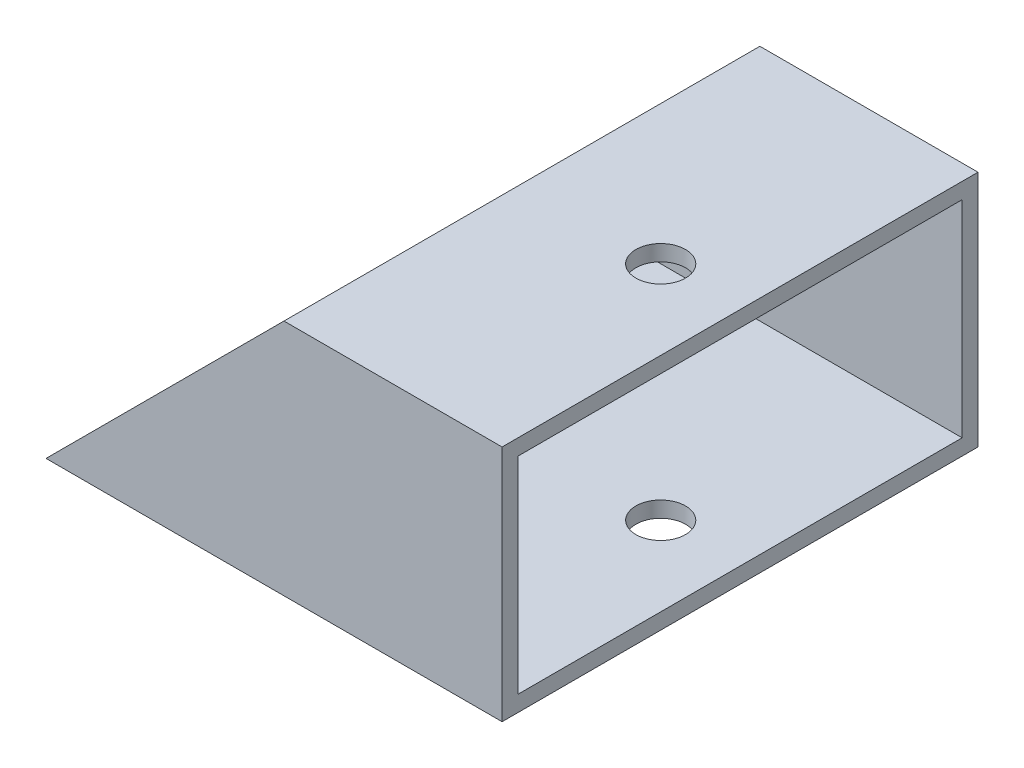
ISO-10303-21;
HEADER;
FILE_DESCRIPTION(('STEP AP214'),'2;1');
FILE_NAME('part.step','',(''),(''),'','','');
FILE_SCHEMA(('AUTOMOTIVE_DESIGN { 1 0 10303 214 1 1 1 1 }'));
ENDSEC;
DATA;
#1=APPLICATION_CONTEXT('core data for automotive mechanical design processes');
#2=APPLICATION_PROTOCOL_DEFINITION('international standard','automotive_design',2000,#1);
#3=PRODUCT_CONTEXT('',#1,'mechanical');
#4=PRODUCT('Part','Part','',(#3));
#5=PRODUCT_RELATED_PRODUCT_CATEGORY('part','',(#4));
#6=PRODUCT_DEFINITION_FORMATION('','',#4);
#7=PRODUCT_DEFINITION_CONTEXT('part definition',#1,'design');
#8=PRODUCT_DEFINITION('design','',#6,#7);
#9=PRODUCT_DEFINITION_SHAPE('','',#8);
#10=(LENGTH_UNIT() NAMED_UNIT(*) SI_UNIT(.MILLI.,.METRE.));
#11=(NAMED_UNIT(*) PLANE_ANGLE_UNIT() SI_UNIT($,.RADIAN.));
#12=(NAMED_UNIT(*) SI_UNIT($,.STERADIAN.) SOLID_ANGLE_UNIT());
#13=UNCERTAINTY_MEASURE_WITH_UNIT(LENGTH_MEASURE(1.E-05),#10,'distance_accuracy_value','');
#14=(GEOMETRIC_REPRESENTATION_CONTEXT(3) GLOBAL_UNCERTAINTY_ASSIGNED_CONTEXT((#13)) GLOBAL_UNIT_ASSIGNED_CONTEXT((#10,
#11,#12)) REPRESENTATION_CONTEXT('',''));
#15=CARTESIAN_POINT('',(0.,0.,0.));
#16=DIRECTION('',(0.,0.,1.));
#17=DIRECTION('',(1.,0.,0.));
#18=AXIS2_PLACEMENT_3D('',#15,#16,#17);
#19=CARTESIAN_POINT('',(101.6,19.05,-38.1));
#20=DIRECTION('',(0.,0.,1.));
#21=DIRECTION('',(1.,0.,0.));
#22=AXIS2_PLACEMENT_3D('',#19,#20,#21);
#23=PLANE('',#22);
#24=DIRECTION('',(-1.,0.,0.));
#25=VECTOR('',#24,1.);
#26=CARTESIAN_POINT('',(101.6,-19.05,-38.1));
#27=LINE('',#26,#25);
#28=CARTESIAN_POINT('',(101.6,-19.05,-38.1));
#29=VERTEX_POINT('',#28);
#30=CARTESIAN_POINT('',(28.575,-19.05,-38.1));
#31=VERTEX_POINT('',#30);
#32=EDGE_CURVE('E142',#29,#31,#27,.T.);
#33=ORIENTED_EDGE('',*,*,#32,.T.);
#34=DIRECTION('',(-0.707106781186544,-0.707106781186551,0.));
#35=VECTOR('',#34,1.);
#36=CARTESIAN_POINT('',(28.575,-19.05,-38.1));
#37=LINE('',#36,#35);
#38=CARTESIAN_POINT('',(66.6749999999996,19.05,-38.1));
#39=VERTEX_POINT('',#38);
#40=EDGE_CURVE('E81',#39,#31,#37,.T.);
#41=ORIENTED_EDGE('',*,*,#40,.F.);
#42=DIRECTION('',(-1.,0.,0.));
#43=VECTOR('',#42,1.);
#44=CARTESIAN_POINT('',(101.6,19.05,-38.1));
#45=LINE('',#44,#43);
#46=CARTESIAN_POINT('',(101.6,19.05,-38.1));
#47=VERTEX_POINT('',#46);
#48=EDGE_CURVE('E12',#47,#39,#45,.T.);
#49=ORIENTED_EDGE('',*,*,#48,.F.);
#50=DIRECTION('',(0.,1.,0.));
#51=VECTOR('',#50,1.);
#52=CARTESIAN_POINT('',(101.6,19.05,-38.1));
#53=LINE('',#52,#51);
#54=EDGE_CURVE('E152',#29,#47,#53,.T.);
#55=ORIENTED_EDGE('',*,*,#54,.F.);
#56=EDGE_LOOP('',(#33,#41,#49,#55));
#57=FACE_BOUND('',#56,.T.);
#58=ADVANCED_FACE('F58',(#57),#23,.F.);
#59=CARTESIAN_POINT('',(101.6,19.05,38.1));
#60=DIRECTION('',(0.,-1.,0.));
#61=DIRECTION('',(0.,0.,-1.));
#62=AXIS2_PLACEMENT_3D('',#59,#60,#61);
#63=PLANE('',#62);
#64=CARTESIAN_POINT('',(88.9,19.05,0.));
#65=DIRECTION('',(0.,1.,0.));
#66=DIRECTION('',(0.,0.,1.));
#67=AXIS2_PLACEMENT_3D('',#64,#65,#66);
#68=CIRCLE('',#67,3.97509999999999);
#69=CARTESIAN_POINT('',(88.9,19.05,3.97509999999999));
#70=VERTEX_POINT('',#69);
#71=EDGE_CURVE('E179',#70,#70,#68,.T.);
#72=ORIENTED_EDGE('',*,*,#71,.F.);
#73=EDGE_LOOP('',(#72));
#74=FACE_BOUND('',#73,.T.);
#75=ORIENTED_EDGE('',*,*,#48,.T.);
#76=DIRECTION('',(0.,0.,-1.));
#77=VECTOR('',#76,1.);
#78=CARTESIAN_POINT('',(66.6749999999996,19.05,38.1));
#79=LINE('',#78,#77);
#80=CARTESIAN_POINT('',(66.6749999999996,19.05,38.1));
#81=VERTEX_POINT('',#80);
#82=EDGE_CURVE('E124',#81,#39,#79,.T.);
#83=ORIENTED_EDGE('',*,*,#82,.F.);
#84=DIRECTION('',(-1.,0.,0.));
#85=VECTOR('',#84,1.);
#86=CARTESIAN_POINT('',(101.6,19.05,38.1));
#87=LINE('',#86,#85);
#88=CARTESIAN_POINT('',(101.6,19.05,38.1));
#89=VERTEX_POINT('',#88);
#90=EDGE_CURVE('E66',#89,#81,#87,.T.);
#91=ORIENTED_EDGE('',*,*,#90,.F.);
#92=DIRECTION('',(0.,0.,1.));
#93=VECTOR('',#92,1.);
#94=CARTESIAN_POINT('',(101.6,19.05,38.1));
#95=LINE('',#94,#93);
#96=EDGE_CURVE('E150',#47,#89,#95,.T.);
#97=ORIENTED_EDGE('',*,*,#96,.F.);
#98=EDGE_LOOP('',(#75,#83,#91,#97));
#99=FACE_BOUND('',#98,.T.);
#100=ADVANCED_FACE('F133',(#74,#99),#63,.F.);
#101=CARTESIAN_POINT('',(101.6,19.05,38.1));
#102=DIRECTION('',(0.,0.,-1.));
#103=DIRECTION('',(-1.,0.,0.));
#104=AXIS2_PLACEMENT_3D('',#101,#102,#103);
#105=PLANE('',#104);
#106=ORIENTED_EDGE('',*,*,#90,.T.);
#107=DIRECTION('',(-0.707106781186544,-0.707106781186551,0.));
#108=VECTOR('',#107,1.);
#109=CARTESIAN_POINT('',(28.575,-19.05,38.1));
#110=LINE('',#109,#108);
#111=CARTESIAN_POINT('',(28.575,-19.05,38.1));
#112=VERTEX_POINT('',#111);
#113=EDGE_CURVE('E121',#81,#112,#110,.T.);
#114=ORIENTED_EDGE('',*,*,#113,.T.);
#115=DIRECTION('',(-1.,0.,0.));
#116=VECTOR('',#115,1.);
#117=CARTESIAN_POINT('',(101.6,-19.05,38.1));
#118=LINE('',#117,#116);
#119=CARTESIAN_POINT('',(101.6,-19.05,38.1));
#120=VERTEX_POINT('',#119);
#121=EDGE_CURVE('E140',#120,#112,#118,.T.);
#122=ORIENTED_EDGE('',*,*,#121,.F.);
#123=DIRECTION('',(0.,-1.,0.));
#124=VECTOR('',#123,1.);
#125=CARTESIAN_POINT('',(101.6,19.05,38.1));
#126=LINE('',#125,#124);
#127=EDGE_CURVE('E139',#89,#120,#126,.T.);
#128=ORIENTED_EDGE('',*,*,#127,.F.);
#129=EDGE_LOOP('',(#106,#114,#122,#128));
#130=FACE_BOUND('',#129,.T.);
#131=ADVANCED_FACE('F138',(#130),#105,.F.);
#132=CARTESIAN_POINT('',(101.6,-19.05,38.1));
#133=DIRECTION('',(0.,1.,0.));
#134=DIRECTION('',(0.,0.,1.));
#135=AXIS2_PLACEMENT_3D('',#132,#133,#134);
#136=PLANE('',#135);
#137=CARTESIAN_POINT('',(41.275,-19.05,-25.4));
#138=DIRECTION('',(0.,1.,0.));
#139=DIRECTION('',(0.,0.,1.));
#140=AXIS2_PLACEMENT_3D('',#137,#138,#139);
#141=CIRCLE('',#140,1.5875);
#142=CARTESIAN_POINT('',(41.275,-19.05,-23.8125));
#143=VERTEX_POINT('',#142);
#144=EDGE_CURVE('E203',#143,#143,#141,.T.);
#145=ORIENTED_EDGE('',*,*,#144,.T.);
#146=EDGE_LOOP('',(#145));
#147=FACE_BOUND('',#146,.T.);
#148=CARTESIAN_POINT('',(41.275,-19.05,25.4));
#149=DIRECTION('',(0.,1.,0.));
#150=DIRECTION('',(0.,0.,1.));
#151=AXIS2_PLACEMENT_3D('',#148,#149,#150);
#152=CIRCLE('',#151,1.5875);
#153=CARTESIAN_POINT('',(41.275,-19.05,26.9875));
#154=VERTEX_POINT('',#153);
#155=EDGE_CURVE('E197',#154,#154,#152,.T.);
#156=ORIENTED_EDGE('',*,*,#155,.T.);
#157=EDGE_LOOP('',(#156));
#158=FACE_BOUND('',#157,.T.);
#159=CARTESIAN_POINT('',(41.275,-19.05,0.));
#160=DIRECTION('',(0.,1.,0.));
#161=DIRECTION('',(0.,0.,1.));
#162=AXIS2_PLACEMENT_3D('',#159,#160,#161);
#163=CIRCLE('',#162,1.5875);
#164=CARTESIAN_POINT('',(41.275,-19.05,1.58750000000001));
#165=VERTEX_POINT('',#164);
#166=EDGE_CURVE('E192',#165,#165,#163,.T.);
#167=ORIENTED_EDGE('',*,*,#166,.T.);
#168=EDGE_LOOP('',(#167));
#169=FACE_BOUND('',#168,.T.);
#170=CARTESIAN_POINT('',(88.9,-19.05,0.));
#171=DIRECTION('',(0.,1.,0.));
#172=DIRECTION('',(0.,0.,1.));
#173=AXIS2_PLACEMENT_3D('',#170,#171,#172);
#174=CIRCLE('',#173,3.97509999999999);
#175=CARTESIAN_POINT('',(88.9,-19.05,3.97509999999999));
#176=VERTEX_POINT('',#175);
#177=EDGE_CURVE('E182',#176,#176,#174,.T.);
#178=ORIENTED_EDGE('',*,*,#177,.T.);
#179=EDGE_LOOP('',(#178));
#180=FACE_BOUND('',#179,.T.);
#181=DIRECTION('',(0.,0.,1.));
#182=VECTOR('',#181,1.);
#183=CARTESIAN_POINT('',(28.575,-19.05,-38.1));
#184=LINE('',#183,#182);
#185=EDGE_CURVE('E125',#31,#112,#184,.T.);
#186=ORIENTED_EDGE('',*,*,#185,.F.);
#187=ORIENTED_EDGE('',*,*,#32,.F.);
#188=DIRECTION('',(0.,0.,-1.));
#189=VECTOR('',#188,1.);
#190=CARTESIAN_POINT('',(101.6,-19.05,38.1));
#191=LINE('',#190,#189);
#192=EDGE_CURVE('E147',#120,#29,#191,.T.);
#193=ORIENTED_EDGE('',*,*,#192,.F.);
#194=ORIENTED_EDGE('',*,*,#121,.T.);
#195=EDGE_LOOP('',(#186,#187,#193,#194));
#196=FACE_BOUND('',#195,.T.);
#197=ADVANCED_FACE('F212',(#147,#158,#169,#180,#196),#136,.F.);
#198=CARTESIAN_POINT('',(101.6,19.05,-35.56));
#199=DIRECTION('',(0.,0.,1.));
#200=DIRECTION('',(1.,0.,0.));
#201=AXIS2_PLACEMENT_3D('',#198,#199,#200);
#202=PLANE('',#201);
#203=DIRECTION('',(0.707106781186544,0.707106781186551,0.));
#204=VECTOR('',#203,1.);
#205=CARTESIAN_POINT('',(84.1374999999996,36.5125000000002,-35.56));
#206=LINE('',#205,#204);
#207=CARTESIAN_POINT('',(31.115,-16.51,-35.56));
#208=VERTEX_POINT('',#207);
#209=CARTESIAN_POINT('',(64.1349999999996,16.51,-35.56));
#210=VERTEX_POINT('',#209);
#211=EDGE_CURVE('E186',#208,#210,#206,.T.);
#212=ORIENTED_EDGE('',*,*,#211,.F.);
#213=DIRECTION('',(-1.,0.,0.));
#214=VECTOR('',#213,1.);
#215=CARTESIAN_POINT('',(101.6,-16.51,-35.56));
#216=LINE('',#215,#214);
#217=CARTESIAN_POINT('',(101.6,-16.51,-35.56));
#218=VERTEX_POINT('',#217);
#219=EDGE_CURVE('E164',#218,#208,#216,.T.);
#220=ORIENTED_EDGE('',*,*,#219,.F.);
#221=DIRECTION('',(0.,1.,0.));
#222=VECTOR('',#221,1.);
#223=CARTESIAN_POINT('',(101.6,19.05,-35.56));
#224=LINE('',#223,#222);
#225=CARTESIAN_POINT('',(101.6,16.51,-35.56));
#226=VERTEX_POINT('',#225);
#227=EDGE_CURVE('E174',#218,#226,#224,.T.);
#228=ORIENTED_EDGE('',*,*,#227,.T.);
#229=DIRECTION('',(-1.,0.,0.));
#230=VECTOR('',#229,1.);
#231=CARTESIAN_POINT('',(101.6,16.51,-35.56));
#232=LINE('',#231,#230);
#233=EDGE_CURVE('E155',#226,#210,#232,.T.);
#234=ORIENTED_EDGE('',*,*,#233,.T.);
#235=EDGE_LOOP('',(#212,#220,#228,#234));
#236=FACE_BOUND('',#235,.T.);
#237=ADVANCED_FACE('F245',(#236),#202,.T.);
#238=CARTESIAN_POINT('',(101.6,16.51,38.1));
#239=DIRECTION('',(0.,-1.,0.));
#240=DIRECTION('',(0.,0.,-1.));
#241=AXIS2_PLACEMENT_3D('',#238,#239,#240);
#242=PLANE('',#241);
#243=DIRECTION('',(0.,0.,1.));
#244=VECTOR('',#243,1.);
#245=CARTESIAN_POINT('',(64.1349999999996,16.51,38.1));
#246=LINE('',#245,#244);
#247=CARTESIAN_POINT('',(64.1349999999996,16.51,35.56));
#248=VERTEX_POINT('',#247);
#249=EDGE_CURVE('E188',#210,#248,#246,.T.);
#250=ORIENTED_EDGE('',*,*,#249,.F.);
#251=ORIENTED_EDGE('',*,*,#233,.F.);
#252=DIRECTION('',(0.,0.,1.));
#253=VECTOR('',#252,1.);
#254=CARTESIAN_POINT('',(101.6,16.51,38.1));
#255=LINE('',#254,#253);
#256=CARTESIAN_POINT('',(101.6,16.51,35.56));
#257=VERTEX_POINT('',#256);
#258=EDGE_CURVE('E172',#226,#257,#255,.T.);
#259=ORIENTED_EDGE('',*,*,#258,.T.);
#260=DIRECTION('',(-1.,0.,0.));
#261=VECTOR('',#260,1.);
#262=CARTESIAN_POINT('',(101.6,16.51,35.56));
#263=LINE('',#262,#261);
#264=EDGE_CURVE('E158',#257,#248,#263,.T.);
#265=ORIENTED_EDGE('',*,*,#264,.T.);
#266=EDGE_LOOP('',(#250,#251,#259,#265));
#267=FACE_BOUND('',#266,.T.);
#268=CARTESIAN_POINT('',(88.9,16.51,0.));
#269=DIRECTION('',(0.,-1.,0.));
#270=DIRECTION('',(0.,0.,-1.));
#271=AXIS2_PLACEMENT_3D('',#268,#269,#270);
#272=CIRCLE('',#271,3.97509999999999);
#273=CARTESIAN_POINT('',(88.9,16.51,-3.97509999999999));
#274=VERTEX_POINT('',#273);
#275=EDGE_CURVE('E176',#274,#274,#272,.T.);
#276=ORIENTED_EDGE('',*,*,#275,.F.);
#277=EDGE_LOOP('',(#276));
#278=FACE_BOUND('',#277,.T.);
#279=ADVANCED_FACE('F264',(#267,#278),#242,.T.);
#280=CARTESIAN_POINT('',(101.6,19.05,35.56));
#281=DIRECTION('',(0.,0.,-1.));
#282=DIRECTION('',(-1.,0.,0.));
#283=AXIS2_PLACEMENT_3D('',#280,#281,#282);
#284=PLANE('',#283);
#285=DIRECTION('',(-0.707106781186544,-0.707106781186551,0.));
#286=VECTOR('',#285,1.);
#287=CARTESIAN_POINT('',(84.1374999999996,36.5125000000002,35.56));
#288=LINE('',#287,#286);
#289=CARTESIAN_POINT('',(31.115,-16.51,35.56));
#290=VERTEX_POINT('',#289);
#291=EDGE_CURVE('E73',#248,#290,#288,.T.);
#292=ORIENTED_EDGE('',*,*,#291,.F.);
#293=ORIENTED_EDGE('',*,*,#264,.F.);
#294=DIRECTION('',(0.,-1.,0.));
#295=VECTOR('',#294,1.);
#296=CARTESIAN_POINT('',(101.6,19.05,35.56));
#297=LINE('',#296,#295);
#298=CARTESIAN_POINT('',(101.6,-16.51,35.56));
#299=VERTEX_POINT('',#298);
#300=EDGE_CURVE('E169',#257,#299,#297,.T.);
#301=ORIENTED_EDGE('',*,*,#300,.T.);
#302=DIRECTION('',(-1.,0.,0.));
#303=VECTOR('',#302,1.);
#304=CARTESIAN_POINT('',(101.6,-16.51,35.56));
#305=LINE('',#304,#303);
#306=EDGE_CURVE('E161',#299,#290,#305,.T.);
#307=ORIENTED_EDGE('',*,*,#306,.T.);
#308=EDGE_LOOP('',(#292,#293,#301,#307));
#309=FACE_BOUND('',#308,.T.);
#310=ADVANCED_FACE('F227',(#309),#284,.T.);
#311=CARTESIAN_POINT('',(101.6,-16.51,38.1));
#312=DIRECTION('',(0.,1.,0.));
#313=DIRECTION('',(0.,0.,1.));
#314=AXIS2_PLACEMENT_3D('',#311,#312,#313);
#315=PLANE('',#314);
#316=CARTESIAN_POINT('',(41.275,-16.51,-25.4));
#317=DIRECTION('',(0.,1.,0.));
#318=DIRECTION('',(0.,0.,1.));
#319=AXIS2_PLACEMENT_3D('',#316,#317,#318);
#320=CIRCLE('',#319,1.5875);
#321=CARTESIAN_POINT('',(41.275,-16.51,-23.8125));
#322=VERTEX_POINT('',#321);
#323=EDGE_CURVE('E200',#322,#322,#320,.T.);
#324=ORIENTED_EDGE('',*,*,#323,.F.);
#325=EDGE_LOOP('',(#324));
#326=FACE_BOUND('',#325,.T.);
#327=CARTESIAN_POINT('',(41.275,-16.51,25.4));
#328=DIRECTION('',(0.,1.,0.));
#329=DIRECTION('',(0.,0.,1.));
#330=AXIS2_PLACEMENT_3D('',#327,#328,#329);
#331=CIRCLE('',#330,1.5875);
#332=CARTESIAN_POINT('',(41.275,-16.51,26.9875));
#333=VERTEX_POINT('',#332);
#334=EDGE_CURVE('E206',#333,#333,#331,.T.);
#335=ORIENTED_EDGE('',*,*,#334,.F.);
#336=EDGE_LOOP('',(#335));
#337=FACE_BOUND('',#336,.T.);
#338=CARTESIAN_POINT('',(41.275,-16.51,0.));
#339=DIRECTION('',(0.,1.,0.));
#340=DIRECTION('',(0.,0.,1.));
#341=AXIS2_PLACEMENT_3D('',#338,#339,#340);
#342=CIRCLE('',#341,1.5875);
#343=CARTESIAN_POINT('',(41.275,-16.51,1.58750000000001));
#344=VERTEX_POINT('',#343);
#345=EDGE_CURVE('E194',#344,#344,#342,.T.);
#346=ORIENTED_EDGE('',*,*,#345,.F.);
#347=EDGE_LOOP('',(#346));
#348=FACE_BOUND('',#347,.T.);
#349=DIRECTION('',(0.,0.,-1.));
#350=VECTOR('',#349,1.);
#351=CARTESIAN_POINT('',(31.115,-16.51,38.1));
#352=LINE('',#351,#350);
#353=EDGE_CURVE('E136',#290,#208,#352,.T.);
#354=ORIENTED_EDGE('',*,*,#353,.F.);
#355=ORIENTED_EDGE('',*,*,#306,.F.);
#356=DIRECTION('',(0.,0.,-1.));
#357=VECTOR('',#356,1.);
#358=CARTESIAN_POINT('',(101.6,-16.51,38.1));
#359=LINE('',#358,#357);
#360=EDGE_CURVE('E167',#299,#218,#359,.T.);
#361=ORIENTED_EDGE('',*,*,#360,.T.);
#362=ORIENTED_EDGE('',*,*,#219,.T.);
#363=EDGE_LOOP('',(#354,#355,#361,#362));
#364=FACE_BOUND('',#363,.T.);
#365=CARTESIAN_POINT('',(88.9,-16.51,0.));
#366=DIRECTION('',(0.,1.,0.));
#367=DIRECTION('',(0.,0.,1.));
#368=AXIS2_PLACEMENT_3D('',#365,#366,#367);
#369=CIRCLE('',#368,3.97509999999999);
#370=CARTESIAN_POINT('',(88.9,-16.51,3.97509999999999));
#371=VERTEX_POINT('',#370);
#372=EDGE_CURVE('E61',#371,#371,#369,.T.);
#373=ORIENTED_EDGE('',*,*,#372,.F.);
#374=EDGE_LOOP('',(#373));
#375=FACE_BOUND('',#374,.T.);
#376=ADVANCED_FACE('F223',(#326,#337,#348,#364,#375),#315,.T.);
#377=CARTESIAN_POINT('',(101.6,0.,0.));
#378=DIRECTION('',(1.,0.,0.));
#379=DIRECTION('',(0.,0.,-1.));
#380=AXIS2_PLACEMENT_3D('',#377,#378,#379);
#381=PLANE('',#380);
#382=ORIENTED_EDGE('',*,*,#54,.T.);
#383=ORIENTED_EDGE('',*,*,#96,.T.);
#384=ORIENTED_EDGE('',*,*,#127,.T.);
#385=ORIENTED_EDGE('',*,*,#192,.T.);
#386=EDGE_LOOP('',(#382,#383,#384,#385));
#387=FACE_BOUND('',#386,.T.);
#388=ORIENTED_EDGE('',*,*,#258,.F.);
#389=ORIENTED_EDGE('',*,*,#227,.F.);
#390=ORIENTED_EDGE('',*,*,#360,.F.);
#391=ORIENTED_EDGE('',*,*,#300,.F.);
#392=EDGE_LOOP('',(#388,#389,#390,#391));
#393=FACE_BOUND('',#392,.T.);
#394=ADVANCED_FACE('F226',(#387,#393),#381,.T.);
#395=CARTESIAN_POINT('',(88.9,-19.05,0.));
#396=DIRECTION('',(0.,1.,0.));
#397=DIRECTION('',(0.,0.,1.));
#398=AXIS2_PLACEMENT_3D('',#395,#396,#397);
#399=CYLINDRICAL_SURFACE('',#398,3.97509999999999);
#400=ORIENTED_EDGE('',*,*,#372,.T.);
#401=EDGE_LOOP('',(#400));
#402=FACE_BOUND('',#401,.T.);
#403=ORIENTED_EDGE('',*,*,#177,.F.);
#404=EDGE_LOOP('',(#403));
#405=FACE_BOUND('',#404,.T.);
#406=ADVANCED_FACE('F236',(#402,#405),#399,.F.);
#407=ORIENTED_EDGE('',*,*,#275,.T.);
#408=EDGE_LOOP('',(#407));
#409=FACE_BOUND('',#408,.T.);
#410=ORIENTED_EDGE('',*,*,#71,.T.);
#411=EDGE_LOOP('',(#410));
#412=FACE_BOUND('',#411,.T.);
#413=ADVANCED_FACE('F239',(#409,#412),#399,.F.);
#414=CARTESIAN_POINT('',(28.575,-19.05,38.1));
#415=DIRECTION('',(0.707106781186551,-0.707106781186544,0.));
#416=DIRECTION('',(0.707106781186544,0.707106781186551,0.));
#417=AXIS2_PLACEMENT_3D('',#414,#415,#416);
#418=PLANE('',#417);
#419=ORIENTED_EDGE('',*,*,#211,.T.);
#420=ORIENTED_EDGE('',*,*,#249,.T.);
#421=ORIENTED_EDGE('',*,*,#291,.T.);
#422=ORIENTED_EDGE('',*,*,#353,.T.);
#423=EDGE_LOOP('',(#419,#420,#421,#422));
#424=FACE_BOUND('',#423,.T.);
#425=ORIENTED_EDGE('',*,*,#40,.T.);
#426=ORIENTED_EDGE('',*,*,#185,.T.);
#427=ORIENTED_EDGE('',*,*,#113,.F.);
#428=ORIENTED_EDGE('',*,*,#82,.T.);
#429=EDGE_LOOP('',(#425,#426,#427,#428));
#430=FACE_BOUND('',#429,.T.);
#431=ADVANCED_FACE('F123',(#424,#430),#418,.F.);
#432=CARTESIAN_POINT('',(41.275,-19.05,0.));
#433=DIRECTION('',(0.,1.,0.));
#434=DIRECTION('',(0.,0.,1.));
#435=AXIS2_PLACEMENT_3D('',#432,#433,#434);
#436=CYLINDRICAL_SURFACE('',#435,1.5875);
#437=ORIENTED_EDGE('',*,*,#166,.F.);
#438=EDGE_LOOP('',(#437));
#439=FACE_BOUND('',#438,.T.);
#440=ORIENTED_EDGE('',*,*,#345,.T.);
#441=EDGE_LOOP('',(#440));
#442=FACE_BOUND('',#441,.T.);
#443=ADVANCED_FACE('F219',(#439,#442),#436,.F.);
#444=CARTESIAN_POINT('',(41.275,-19.05,25.4));
#445=DIRECTION('',(0.,1.,0.));
#446=DIRECTION('',(0.,0.,1.));
#447=AXIS2_PLACEMENT_3D('',#444,#445,#446);
#448=CYLINDRICAL_SURFACE('',#447,1.5875);
#449=ORIENTED_EDGE('',*,*,#155,.F.);
#450=EDGE_LOOP('',(#449));
#451=FACE_BOUND('',#450,.T.);
#452=ORIENTED_EDGE('',*,*,#334,.T.);
#453=EDGE_LOOP('',(#452));
#454=FACE_BOUND('',#453,.T.);
#455=ADVANCED_FACE('F215',(#451,#454),#448,.F.);
#456=CARTESIAN_POINT('',(41.275,-19.05,-25.4));
#457=DIRECTION('',(0.,1.,0.));
#458=DIRECTION('',(0.,0.,1.));
#459=AXIS2_PLACEMENT_3D('',#456,#457,#458);
#460=CYLINDRICAL_SURFACE('',#459,1.5875);
#461=ORIENTED_EDGE('',*,*,#144,.F.);
#462=EDGE_LOOP('',(#461));
#463=FACE_BOUND('',#462,.T.);
#464=ORIENTED_EDGE('',*,*,#323,.T.);
#465=EDGE_LOOP('',(#464));
#466=FACE_BOUND('',#465,.T.);
#467=ADVANCED_FACE('F218',(#463,#466),#460,.F.);
#468=CLOSED_SHELL('',(#58,#100,#131,#197,#237,#279,#310,#376,#394,#406,#413,#431,#443,#455,#467));
#469=MANIFOLD_SOLID_BREP('B2',#468);
#470=ADVANCED_BREP_SHAPE_REPRESENTATION('',(#18,#469),#14);
#471=SHAPE_DEFINITION_REPRESENTATION(#9,#470);
ENDSEC;
END-ISO-10303-21;
